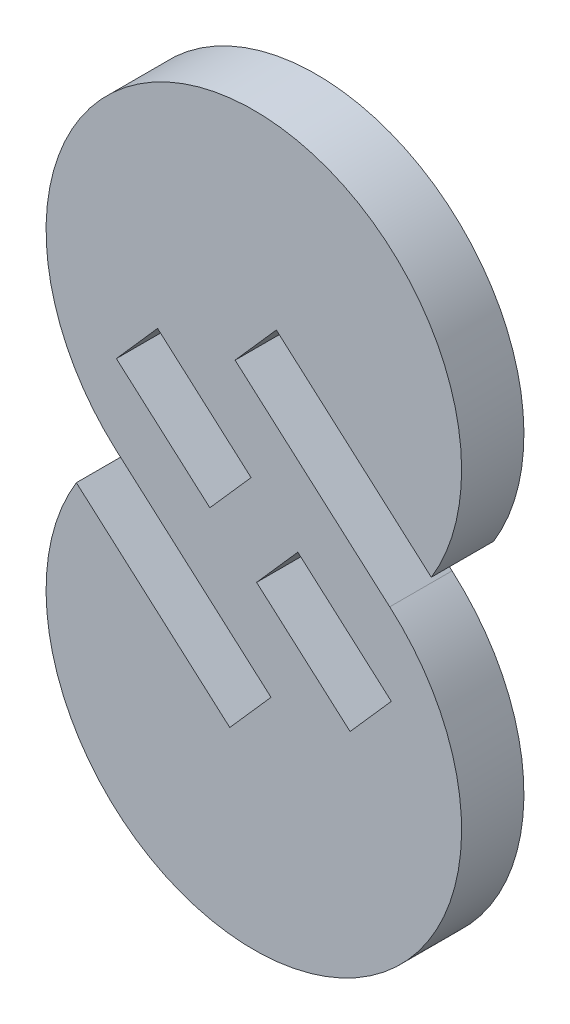
ISO-10303-21;
HEADER;
FILE_DESCRIPTION(('STEP AP214'),'2;1');
FILE_NAME('part.step','',(''),(''),'','','');
FILE_SCHEMA(('AUTOMOTIVE_DESIGN { 1 0 10303 214 1 1 1 1 }'));
ENDSEC;
DATA;
#1=APPLICATION_CONTEXT('core data for automotive mechanical design processes');
#2=APPLICATION_PROTOCOL_DEFINITION('international standard','automotive_design',2000,#1);
#3=PRODUCT_CONTEXT('',#1,'mechanical');
#4=PRODUCT('Part','Part','',(#3));
#5=PRODUCT_RELATED_PRODUCT_CATEGORY('part','',(#4));
#6=PRODUCT_DEFINITION_FORMATION('','',#4);
#7=PRODUCT_DEFINITION_CONTEXT('part definition',#1,'design');
#8=PRODUCT_DEFINITION('design','',#6,#7);
#9=PRODUCT_DEFINITION_SHAPE('','',#8);
#10=(LENGTH_UNIT() NAMED_UNIT(*) SI_UNIT(.MILLI.,.METRE.));
#11=(NAMED_UNIT(*) PLANE_ANGLE_UNIT() SI_UNIT($,.RADIAN.));
#12=(NAMED_UNIT(*) SI_UNIT($,.STERADIAN.) SOLID_ANGLE_UNIT());
#13=UNCERTAINTY_MEASURE_WITH_UNIT(LENGTH_MEASURE(1.E-05),#10,'distance_accuracy_value','');
#14=(GEOMETRIC_REPRESENTATION_CONTEXT(3) GLOBAL_UNCERTAINTY_ASSIGNED_CONTEXT((#13)) GLOBAL_UNIT_ASSIGNED_CONTEXT((#10,
#11,#12)) REPRESENTATION_CONTEXT('',''));
#15=CARTESIAN_POINT('',(0.,0.,0.));
#16=DIRECTION('',(0.,0.,1.));
#17=DIRECTION('',(1.,0.,0.));
#18=AXIS2_PLACEMENT_3D('',#15,#16,#17);
#19=CARTESIAN_POINT('',(0.,-15.,3.));
#20=DIRECTION('',(0.,0.,1.));
#21=DIRECTION('',(1.,0.,0.));
#22=AXIS2_PLACEMENT_3D('',#19,#20,#21);
#23=PLANE('',#22);
#24=DIRECTION('',(-0.66144277432984,-0.749995637511875,0.));
#25=VECTOR('',#24,1.);
#26=CARTESIAN_POINT('',(2.59569605670494,-2.28921918367393,3.));
#27=LINE('',#26,#25);
#28=CARTESIAN_POINT('',(-0.132829294773053,-5.38303499037377,3.));
#29=VERTEX_POINT('',#28);
#30=CARTESIAN_POINT('',(-2.11715761776257,-7.63302190290939,3.));
#31=VERTEX_POINT('',#30);
#32=EDGE_CURVE('E165',#29,#31,#27,.T.);
#33=ORIENTED_EDGE('',*,*,#32,.T.);
#34=DIRECTION('',(-0.749995637511876,0.66144277432984,0.));
#35=VECTOR('',#34,1.);
#36=CARTESIAN_POINT('',(-4.71285367446752,-5.34380271923547,3.));
#37=LINE('',#36,#35);
#38=CARTESIAN_POINT('',(-6.61713144283383,-3.66436525693035,3.));
#39=VERTEX_POINT('',#38);
#40=EDGE_CURVE('E152',#31,#39,#37,.T.);
#41=ORIENTED_EDGE('',*,*,#40,.T.);
#42=DIRECTION('',(0.66144277432984,0.749995637511876,0.));
#43=VECTOR('',#42,1.);
#44=CARTESIAN_POINT('',(-1.90427776836631,1.67943746230511,3.));
#45=LINE('',#44,#43);
#46=CARTESIAN_POINT('',(-4.63280311984431,-1.41437834439473,3.));
#47=VERTEX_POINT('',#46);
#48=EDGE_CURVE('E177',#39,#47,#45,.T.);
#49=ORIENTED_EDGE('',*,*,#48,.T.);
#50=DIRECTION('',(-0.749995637511876,0.66144277432984,0.));
#51=VECTOR('',#50,1.);
#52=CARTESIAN_POINT('',(-2.728525351478,-3.09381580669984,3.));
#53=LINE('',#52,#51);
#54=EDGE_CURVE('E173',#29,#47,#53,.T.);
#55=ORIENTED_EDGE('',*,*,#54,.F.);
#56=EDGE_LOOP('',(#33,#41,#49,#55));
#57=FACE_BOUND('',#56,.T.);
#58=DIRECTION('',(-0.66144277432984,-0.749995637511876,0.));
#59=VECTOR('',#58,1.);
#60=CARTESIAN_POINT('',(1.08324299669159,1.37770571202348,3.));
#61=LINE('',#60,#59);
#62=CARTESIAN_POINT('',(1.08324299669159,1.37770571202348,3.));
#63=VERTEX_POINT('',#62);
#64=CARTESIAN_POINT('',(-0.901085326297932,-0.872281200512147,3.));
#65=VERTEX_POINT('',#64);
#66=EDGE_CURVE('E222',#63,#65,#61,.T.);
#67=ORIENTED_EDGE('',*,*,#66,.F.);
#68=DIRECTION('',(0.749995637511875,-0.66144277432984,0.));
#69=VECTOR('',#68,1.);
#70=CARTESIAN_POINT('',(1.08324299669159,1.37770571202348,3.));
#71=LINE('',#70,#69);
#72=CARTESIAN_POINT('',(8.54162712741715,-5.20005827045923,3.));
#73=VERTEX_POINT('',#72);
#74=EDGE_CURVE('E240',#63,#73,#71,.T.);
#75=ORIENTED_EDGE('',*,*,#74,.T.);
#76=CARTESIAN_POINT('',(0.,0.,3.));
#77=DIRECTION('',(0.,0.,1.));
#78=DIRECTION('',(1.,0.,0.));
#79=AXIS2_PLACEMENT_3D('',#76,#77,#78);
#80=CIRCLE('',#79,10.);
#81=CARTESIAN_POINT('',(-6.6144277432984,-7.49995637511875,3.));
#82=VERTEX_POINT('',#81);
#83=EDGE_CURVE('E238',#73,#82,#80,.T.);
#84=ORIENTED_EDGE('',*,*,#83,.T.);
#85=DIRECTION('',(0.749995637511876,-0.66144277432984,0.));
#86=VECTOR('',#85,1.);
#87=CARTESIAN_POINT('',(-6.6144277432984,-7.49995637511875,3.));
#88=LINE('',#87,#86);
#89=CARTESIAN_POINT('',(0.826760184868579,-14.0625545308161,3.));
#90=VERTEX_POINT('',#89);
#91=EDGE_CURVE('E236',#82,#90,#88,.T.);
#92=ORIENTED_EDGE('',*,*,#91,.T.);
#93=DIRECTION('',(-0.661442774329841,-0.749995637511874,0.));
#94=VECTOR('',#93,1.);
#95=CARTESIAN_POINT('',(0.826760184868579,-14.0625545308161,3.));
#96=LINE('',#95,#94);
#97=CARTESIAN_POINT('',(-1.15756813812094,-16.3125414433517,3.));
#98=VERTEX_POINT('',#97);
#99=EDGE_CURVE('E234',#90,#98,#96,.T.);
#100=ORIENTED_EDGE('',*,*,#99,.T.);
#101=DIRECTION('',(0.749995637511875,-0.66144277432984,0.));
#102=VECTOR('',#101,1.);
#103=CARTESIAN_POINT('',(-8.54193177258285,-9.80005827045922,3.));
#104=LINE('',#103,#102);
#105=CARTESIAN_POINT('',(-8.54193177258285,-9.80005827045922,3.));
#106=VERTEX_POINT('',#105);
#107=EDGE_CURVE('E231',#106,#98,#104,.T.);
#108=ORIENTED_EDGE('',*,*,#107,.F.);
#109=CARTESIAN_POINT('',(0.,-15.,3.));
#110=DIRECTION('',(0.,0.,1.));
#111=DIRECTION('',(1.,0.,0.));
#112=AXIS2_PLACEMENT_3D('',#109,#110,#111);
#113=CIRCLE('',#112,10.0001996179116);
#114=CARTESIAN_POINT('',(6.54010260186905,-7.43487935620947,3.));
#115=VERTEX_POINT('',#114);
#116=EDGE_CURVE('E229',#106,#115,#113,.T.);
#117=ORIENTED_EDGE('',*,*,#116,.T.);
#118=DIRECTION('',(0.749995637511876,-0.66144277432984,0.));
#119=VECTOR('',#118,1.);
#120=CARTESIAN_POINT('',(-0.901085326297932,-0.872281200512147,3.));
#121=LINE('',#120,#119);
#122=EDGE_CURVE('E225',#65,#115,#121,.T.);
#123=ORIENTED_EDGE('',*,*,#122,.F.);
#124=EDGE_LOOP('',(#67,#75,#84,#92,#100,#108,#117,#123));
#125=FACE_BOUND('',#124,.T.);
#126=DIRECTION('',(-0.749995637511875,0.66144277432984,0.));
#127=VECTOR('',#126,1.);
#128=CARTESIAN_POINT('',(-4.71285367446752,-5.34380271923547,3.));
#129=LINE('',#128,#127);
#130=CARTESIAN_POINT('',(4.6328031198443,-13.5860068718779,3.));
#131=VERTEX_POINT('',#130);
#132=CARTESIAN_POINT('',(0.132829294773053,-9.61735022589891,3.));
#133=VERTEX_POINT('',#132);
#134=EDGE_CURVE('E192',#131,#133,#129,.T.);
#135=ORIENTED_EDGE('',*,*,#134,.T.);
#136=DIRECTION('',(-0.66144277432984,-0.749995637511876,0.));
#137=VECTOR('',#136,1.);
#138=CARTESIAN_POINT('',(4.84568296924057,-4.27354750666345,3.));
#139=LINE('',#138,#137);
#140=CARTESIAN_POINT('',(2.11715761776257,-7.36736331336329,3.));
#141=VERTEX_POINT('',#140);
#142=EDGE_CURVE('E195',#141,#133,#139,.T.);
#143=ORIENTED_EDGE('',*,*,#142,.F.);
#144=DIRECTION('',(-0.749995637511875,0.66144277432984,0.));
#145=VECTOR('',#144,1.);
#146=CARTESIAN_POINT('',(-2.728525351478,-3.09381580669984,3.));
#147=LINE('',#146,#145);
#148=CARTESIAN_POINT('',(6.61713144283382,-11.3360199593423,3.));
#149=VERTEX_POINT('',#148);
#150=EDGE_CURVE('E213',#149,#141,#147,.T.);
#151=ORIENTED_EDGE('',*,*,#150,.F.);
#152=DIRECTION('',(0.661442774329839,0.749995637511876,0.));
#153=VECTOR('',#152,1.);
#154=CARTESIAN_POINT('',(9.34565679431182,-8.24220415264247,3.));
#155=LINE('',#154,#153);
#156=EDGE_CURVE('E64',#131,#149,#155,.T.);
#157=ORIENTED_EDGE('',*,*,#156,.F.);
#158=EDGE_LOOP('',(#135,#143,#151,#157));
#159=FACE_BOUND('',#158,.T.);
#160=ADVANCED_FACE('F39',(#57,#125,#159),#23,.T.);
#161=CARTESIAN_POINT('',(0.,-15.,0.));
#162=DIRECTION('',(0.,0.,1.));
#163=DIRECTION('',(1.,0.,0.));
#164=AXIS2_PLACEMENT_3D('',#161,#162,#163);
#165=PLANE('',#164);
#166=DIRECTION('',(-0.749995637511876,0.66144277432984,0.));
#167=VECTOR('',#166,1.);
#168=CARTESIAN_POINT('',(-4.71285367446752,-5.34380271923547,0.));
#169=LINE('',#168,#167);
#170=CARTESIAN_POINT('',(-2.11715761776257,-7.63302190290939,0.));
#171=VERTEX_POINT('',#170);
#172=CARTESIAN_POINT('',(-6.61713144283383,-3.66436525693036,0.));
#173=VERTEX_POINT('',#172);
#174=EDGE_CURVE('E175',#171,#173,#169,.T.);
#175=ORIENTED_EDGE('',*,*,#174,.F.);
#176=DIRECTION('',(-0.66144277432984,-0.749995637511875,0.));
#177=VECTOR('',#176,1.);
#178=CARTESIAN_POINT('',(2.59569605670494,-2.28921918367393,0.));
#179=LINE('',#178,#177);
#180=CARTESIAN_POINT('',(-0.132829294773054,-5.38303499037377,0.));
#181=VERTEX_POINT('',#180);
#182=EDGE_CURVE('E168',#181,#171,#179,.T.);
#183=ORIENTED_EDGE('',*,*,#182,.F.);
#184=DIRECTION('',(-0.749995637511876,0.66144277432984,0.));
#185=VECTOR('',#184,1.);
#186=CARTESIAN_POINT('',(-2.728525351478,-3.09381580669984,0.));
#187=LINE('',#186,#185);
#188=CARTESIAN_POINT('',(-4.63280311984431,-1.41437834439473,0.));
#189=VERTEX_POINT('',#188);
#190=EDGE_CURVE('E169',#181,#189,#187,.T.);
#191=ORIENTED_EDGE('',*,*,#190,.T.);
#192=DIRECTION('',(0.66144277432984,0.749995637511876,0.));
#193=VECTOR('',#192,1.);
#194=CARTESIAN_POINT('',(-1.90427776836631,1.67943746230511,0.));
#195=LINE('',#194,#193);
#196=EDGE_CURVE('E182',#173,#189,#195,.T.);
#197=ORIENTED_EDGE('',*,*,#196,.F.);
#198=EDGE_LOOP('',(#175,#183,#191,#197));
#199=FACE_BOUND('',#198,.T.);
#200=DIRECTION('',(-0.66144277432984,-0.749995637511876,0.));
#201=VECTOR('',#200,1.);
#202=CARTESIAN_POINT('',(1.08324299669159,1.37770571202348,0.));
#203=LINE('',#202,#201);
#204=CARTESIAN_POINT('',(1.08324299669159,1.37770571202348,0.));
#205=VERTEX_POINT('',#204);
#206=CARTESIAN_POINT('',(-0.901085326297932,-0.872281200512147,0.));
#207=VERTEX_POINT('',#206);
#208=EDGE_CURVE('E160',#205,#207,#203,.T.);
#209=ORIENTED_EDGE('',*,*,#208,.T.);
#210=DIRECTION('',(0.749995637511876,-0.66144277432984,0.));
#211=VECTOR('',#210,1.);
#212=CARTESIAN_POINT('',(-0.901085326297932,-0.872281200512147,0.));
#213=LINE('',#212,#211);
#214=CARTESIAN_POINT('',(6.54010260186905,-7.43487935620947,0.));
#215=VERTEX_POINT('',#214);
#216=EDGE_CURVE('E244',#207,#215,#213,.T.);
#217=ORIENTED_EDGE('',*,*,#216,.T.);
#218=CARTESIAN_POINT('',(0.,-15.,0.));
#219=DIRECTION('',(0.,0.,1.));
#220=DIRECTION('',(1.,0.,0.));
#221=AXIS2_PLACEMENT_3D('',#218,#219,#220);
#222=CIRCLE('',#221,10.0001996179116);
#223=CARTESIAN_POINT('',(-8.54193177258285,-9.80005827045922,0.));
#224=VERTEX_POINT('',#223);
#225=EDGE_CURVE('E247',#224,#215,#222,.T.);
#226=ORIENTED_EDGE('',*,*,#225,.F.);
#227=DIRECTION('',(0.749995637511875,-0.66144277432984,0.));
#228=VECTOR('',#227,1.);
#229=CARTESIAN_POINT('',(-8.54193177258285,-9.80005827045922,0.));
#230=LINE('',#229,#228);
#231=CARTESIAN_POINT('',(-1.15756813812094,-16.3125414433517,0.));
#232=VERTEX_POINT('',#231);
#233=EDGE_CURVE('E250',#224,#232,#230,.T.);
#234=ORIENTED_EDGE('',*,*,#233,.T.);
#235=DIRECTION('',(-0.661442774329841,-0.749995637511874,0.));
#236=VECTOR('',#235,1.);
#237=CARTESIAN_POINT('',(0.826760184868579,-14.0625545308161,0.));
#238=LINE('',#237,#236);
#239=CARTESIAN_POINT('',(0.826760184868579,-14.0625545308161,0.));
#240=VERTEX_POINT('',#239);
#241=EDGE_CURVE('E253',#240,#232,#238,.T.);
#242=ORIENTED_EDGE('',*,*,#241,.F.);
#243=DIRECTION('',(0.749995637511876,-0.66144277432984,0.));
#244=VECTOR('',#243,1.);
#245=CARTESIAN_POINT('',(-6.6144277432984,-7.49995637511875,0.));
#246=LINE('',#245,#244);
#247=CARTESIAN_POINT('',(-6.6144277432984,-7.49995637511875,0.));
#248=VERTEX_POINT('',#247);
#249=EDGE_CURVE('E256',#248,#240,#246,.T.);
#250=ORIENTED_EDGE('',*,*,#249,.F.);
#251=CARTESIAN_POINT('',(0.,0.,0.));
#252=DIRECTION('',(0.,0.,1.));
#253=DIRECTION('',(1.,0.,0.));
#254=AXIS2_PLACEMENT_3D('',#251,#252,#253);
#255=CIRCLE('',#254,10.);
#256=CARTESIAN_POINT('',(8.54162712741715,-5.20005827045923,0.));
#257=VERTEX_POINT('',#256);
#258=EDGE_CURVE('E258',#257,#248,#255,.T.);
#259=ORIENTED_EDGE('',*,*,#258,.F.);
#260=DIRECTION('',(0.749995637511875,-0.66144277432984,0.));
#261=VECTOR('',#260,1.);
#262=CARTESIAN_POINT('',(1.08324299669159,1.37770571202348,0.));
#263=LINE('',#262,#261);
#264=EDGE_CURVE('E226',#205,#257,#263,.T.);
#265=ORIENTED_EDGE('',*,*,#264,.F.);
#266=EDGE_LOOP('',(#209,#217,#226,#234,#242,#250,#259,#265));
#267=FACE_BOUND('',#266,.T.);
#268=DIRECTION('',(-0.66144277432984,-0.749995637511876,0.));
#269=VECTOR('',#268,1.);
#270=CARTESIAN_POINT('',(4.84568296924057,-4.27354750666345,0.));
#271=LINE('',#270,#269);
#272=CARTESIAN_POINT('',(2.11715761776257,-7.36736331336329,0.));
#273=VERTEX_POINT('',#272);
#274=CARTESIAN_POINT('',(0.132829294773053,-9.61735022589891,0.));
#275=VERTEX_POINT('',#274);
#276=EDGE_CURVE('E198',#273,#275,#271,.T.);
#277=ORIENTED_EDGE('',*,*,#276,.T.);
#278=DIRECTION('',(-0.749995637511875,0.66144277432984,0.));
#279=VECTOR('',#278,1.);
#280=CARTESIAN_POINT('',(-4.71285367446752,-5.34380271923547,0.));
#281=LINE('',#280,#279);
#282=CARTESIAN_POINT('',(4.6328031198443,-13.5860068718779,0.));
#283=VERTEX_POINT('',#282);
#284=EDGE_CURVE('E207',#283,#275,#281,.T.);
#285=ORIENTED_EDGE('',*,*,#284,.F.);
#286=DIRECTION('',(0.661442774329839,0.749995637511876,0.));
#287=VECTOR('',#286,1.);
#288=CARTESIAN_POINT('',(9.34565679431182,-8.24220415264247,0.));
#289=LINE('',#288,#287);
#290=CARTESIAN_POINT('',(6.61713144283382,-11.3360199593423,0.));
#291=VERTEX_POINT('',#290);
#292=EDGE_CURVE('E204',#283,#291,#289,.T.);
#293=ORIENTED_EDGE('',*,*,#292,.T.);
#294=DIRECTION('',(-0.749995637511875,0.66144277432984,0.));
#295=VECTOR('',#294,1.);
#296=CARTESIAN_POINT('',(-2.728525351478,-3.09381580669984,0.));
#297=LINE('',#296,#295);
#298=EDGE_CURVE('E201',#291,#273,#297,.T.);
#299=ORIENTED_EDGE('',*,*,#298,.T.);
#300=EDGE_LOOP('',(#277,#285,#293,#299));
#301=FACE_BOUND('',#300,.T.);
#302=ADVANCED_FACE('F284',(#199,#267,#301),#165,.F.);
#303=CARTESIAN_POINT('',(1.08324299669159,1.37770571202348,3.));
#304=DIRECTION('',(0.749995637511876,-0.66144277432984,0.));
#305=DIRECTION('',(0.66144277432984,0.749995637511876,0.));
#306=AXIS2_PLACEMENT_3D('',#303,#304,#305);
#307=PLANE('',#306);
#308=ORIENTED_EDGE('',*,*,#208,.F.);
#309=DIRECTION('',(0.,0.,-1.));
#310=VECTOR('',#309,1.);
#311=CARTESIAN_POINT('',(1.08324299669159,1.37770571202348,3.));
#312=LINE('',#311,#310);
#313=EDGE_CURVE('E11',#63,#205,#312,.T.);
#314=ORIENTED_EDGE('',*,*,#313,.F.);
#315=ORIENTED_EDGE('',*,*,#66,.T.);
#316=DIRECTION('',(0.,0.,-1.));
#317=VECTOR('',#316,1.);
#318=CARTESIAN_POINT('',(-0.901085326297932,-0.872281200512147,3.));
#319=LINE('',#318,#317);
#320=EDGE_CURVE('E43',#65,#207,#319,.T.);
#321=ORIENTED_EDGE('',*,*,#320,.T.);
#322=EDGE_LOOP('',(#308,#314,#315,#321));
#323=FACE_BOUND('',#322,.T.);
#324=ADVANCED_FACE('F41',(#323),#307,.T.);
#325=CARTESIAN_POINT('',(1.08324299669159,1.37770571202348,3.));
#326=DIRECTION('',(0.66144277432984,0.749995637511875,0.));
#327=DIRECTION('',(-0.749995637511875,0.66144277432984,0.));
#328=AXIS2_PLACEMENT_3D('',#325,#326,#327);
#329=PLANE('',#328);
#330=ORIENTED_EDGE('',*,*,#264,.T.);
#331=DIRECTION('',(0.,0.,-1.));
#332=VECTOR('',#331,1.);
#333=CARTESIAN_POINT('',(8.54162712741715,-5.20005827045923,3.));
#334=LINE('',#333,#332);
#335=EDGE_CURVE('E48',#73,#257,#334,.T.);
#336=ORIENTED_EDGE('',*,*,#335,.F.);
#337=ORIENTED_EDGE('',*,*,#74,.F.);
#338=ORIENTED_EDGE('',*,*,#313,.T.);
#339=EDGE_LOOP('',(#330,#336,#337,#338));
#340=FACE_BOUND('',#339,.T.);
#341=ADVANCED_FACE('F290',(#340),#329,.F.);
#342=CARTESIAN_POINT('',(0.,0.,3.));
#343=DIRECTION('',(0.,0.,-1.));
#344=DIRECTION('',(-1.,0.,0.));
#345=AXIS2_PLACEMENT_3D('',#342,#343,#344);
#346=CYLINDRICAL_SURFACE('',#345,10.);
#347=ORIENTED_EDGE('',*,*,#258,.T.);
#348=DIRECTION('',(0.,0.,-1.));
#349=VECTOR('',#348,1.);
#350=CARTESIAN_POINT('',(-6.6144277432984,-7.49995637511875,3.));
#351=LINE('',#350,#349);
#352=EDGE_CURVE('E263',#82,#248,#351,.T.);
#353=ORIENTED_EDGE('',*,*,#352,.F.);
#354=ORIENTED_EDGE('',*,*,#83,.F.);
#355=ORIENTED_EDGE('',*,*,#335,.T.);
#356=EDGE_LOOP('',(#347,#353,#354,#355));
#357=FACE_BOUND('',#356,.T.);
#358=ADVANCED_FACE('F294',(#357),#346,.T.);
#359=CARTESIAN_POINT('',(-6.6144277432984,-7.49995637511875,3.));
#360=DIRECTION('',(0.66144277432984,0.749995637511875,0.));
#361=DIRECTION('',(-0.749995637511875,0.66144277432984,0.));
#362=AXIS2_PLACEMENT_3D('',#359,#360,#361);
#363=PLANE('',#362);
#364=ORIENTED_EDGE('',*,*,#249,.T.);
#365=DIRECTION('',(0.,0.,-1.));
#366=VECTOR('',#365,1.);
#367=CARTESIAN_POINT('',(0.826760184868579,-14.0625545308161,3.));
#368=LINE('',#367,#366);
#369=EDGE_CURVE('E266',#90,#240,#368,.T.);
#370=ORIENTED_EDGE('',*,*,#369,.F.);
#371=ORIENTED_EDGE('',*,*,#91,.F.);
#372=ORIENTED_EDGE('',*,*,#352,.T.);
#373=EDGE_LOOP('',(#364,#370,#371,#372));
#374=FACE_BOUND('',#373,.T.);
#375=ADVANCED_FACE('F312',(#374),#363,.F.);
#376=CARTESIAN_POINT('',(0.826760184868579,-14.0625545308161,3.));
#377=DIRECTION('',(0.749995637511874,-0.661442774329841,0.));
#378=DIRECTION('',(0.661442774329841,0.749995637511874,0.));
#379=AXIS2_PLACEMENT_3D('',#376,#377,#378);
#380=PLANE('',#379);
#381=ORIENTED_EDGE('',*,*,#241,.T.);
#382=DIRECTION('',(0.,0.,-1.));
#383=VECTOR('',#382,1.);
#384=CARTESIAN_POINT('',(-1.15756813812094,-16.3125414433517,3.));
#385=LINE('',#384,#383);
#386=EDGE_CURVE('E269',#98,#232,#385,.T.);
#387=ORIENTED_EDGE('',*,*,#386,.F.);
#388=ORIENTED_EDGE('',*,*,#99,.F.);
#389=ORIENTED_EDGE('',*,*,#369,.T.);
#390=EDGE_LOOP('',(#381,#387,#388,#389));
#391=FACE_BOUND('',#390,.T.);
#392=ADVANCED_FACE('F310',(#391),#380,.F.);
#393=CARTESIAN_POINT('',(-8.54193177258285,-9.80005827045922,3.));
#394=DIRECTION('',(0.66144277432984,0.749995637511875,0.));
#395=DIRECTION('',(-0.749995637511875,0.66144277432984,0.));
#396=AXIS2_PLACEMENT_3D('',#393,#394,#395);
#397=PLANE('',#396);
#398=ORIENTED_EDGE('',*,*,#233,.F.);
#399=DIRECTION('',(0.,0.,-1.));
#400=VECTOR('',#399,1.);
#401=CARTESIAN_POINT('',(-8.54193177258285,-9.80005827045922,3.));
#402=LINE('',#401,#400);
#403=EDGE_CURVE('E271',#106,#224,#402,.T.);
#404=ORIENTED_EDGE('',*,*,#403,.F.);
#405=ORIENTED_EDGE('',*,*,#107,.T.);
#406=ORIENTED_EDGE('',*,*,#386,.T.);
#407=EDGE_LOOP('',(#398,#404,#405,#406));
#408=FACE_BOUND('',#407,.T.);
#409=ADVANCED_FACE('F306',(#408),#397,.T.);
#410=CARTESIAN_POINT('',(0.,-15.,3.));
#411=DIRECTION('',(0.,0.,-1.));
#412=DIRECTION('',(-1.,0.,0.));
#413=AXIS2_PLACEMENT_3D('',#410,#411,#412);
#414=CYLINDRICAL_SURFACE('',#413,10.0001996179116);
#415=ORIENTED_EDGE('',*,*,#225,.T.);
#416=DIRECTION('',(0.,0.,-1.));
#417=VECTOR('',#416,1.);
#418=CARTESIAN_POINT('',(6.54010260186905,-7.43487935620947,3.));
#419=LINE('',#418,#417);
#420=EDGE_CURVE('E272',#115,#215,#419,.T.);
#421=ORIENTED_EDGE('',*,*,#420,.F.);
#422=ORIENTED_EDGE('',*,*,#116,.F.);
#423=ORIENTED_EDGE('',*,*,#403,.T.);
#424=EDGE_LOOP('',(#415,#421,#422,#423));
#425=FACE_BOUND('',#424,.T.);
#426=ADVANCED_FACE('F302',(#425),#414,.T.);
#427=CARTESIAN_POINT('',(-0.901085326297932,-0.872281200512147,3.));
#428=DIRECTION('',(0.66144277432984,0.749995637511876,0.));
#429=DIRECTION('',(-0.749995637511876,0.66144277432984,0.));
#430=AXIS2_PLACEMENT_3D('',#427,#428,#429);
#431=PLANE('',#430);
#432=ORIENTED_EDGE('',*,*,#216,.F.);
#433=ORIENTED_EDGE('',*,*,#320,.F.);
#434=ORIENTED_EDGE('',*,*,#122,.T.);
#435=ORIENTED_EDGE('',*,*,#420,.T.);
#436=EDGE_LOOP('',(#432,#433,#434,#435));
#437=FACE_BOUND('',#436,.T.);
#438=ADVANCED_FACE('F280',(#437),#431,.T.);
#439=CARTESIAN_POINT('',(4.84568296924057,-4.27354750666345,3.001));
#440=DIRECTION('',(0.749995637511876,-0.66144277432984,0.));
#441=DIRECTION('',(0.66144277432984,0.749995637511876,0.));
#442=AXIS2_PLACEMENT_3D('',#439,#440,#441);
#443=PLANE('',#442);
#444=ORIENTED_EDGE('',*,*,#142,.T.);
#445=DIRECTION('',(0.,0.,-1.));
#446=VECTOR('',#445,1.);
#447=CARTESIAN_POINT('',(0.132829294773053,-9.61735022589891,3.001));
#448=LINE('',#447,#446);
#449=EDGE_CURVE('E211',#133,#275,#448,.T.);
#450=ORIENTED_EDGE('',*,*,#449,.T.);
#451=ORIENTED_EDGE('',*,*,#276,.F.);
#452=DIRECTION('',(0.,0.,-1.));
#453=VECTOR('',#452,1.);
#454=CARTESIAN_POINT('',(2.11715761776257,-7.36736331336329,3.001));
#455=LINE('',#454,#453);
#456=EDGE_CURVE('E210',#141,#273,#455,.T.);
#457=ORIENTED_EDGE('',*,*,#456,.F.);
#458=EDGE_LOOP('',(#444,#450,#451,#457));
#459=FACE_BOUND('',#458,.T.);
#460=ADVANCED_FACE('F329',(#459),#443,.T.);
#461=CARTESIAN_POINT('',(-4.71285367446752,-5.34380271923547,3.001));
#462=DIRECTION('',(-0.66144277432984,-0.749995637511875,0.));
#463=DIRECTION('',(0.749995637511875,-0.66144277432984,0.));
#464=AXIS2_PLACEMENT_3D('',#461,#462,#463);
#465=PLANE('',#464);
#466=DIRECTION('',(0.,0.,-1.));
#467=VECTOR('',#466,1.);
#468=CARTESIAN_POINT('',(4.6328031198443,-13.5860068718779,3.001));
#469=LINE('',#468,#467);
#470=EDGE_CURVE('E214',#131,#283,#469,.T.);
#471=ORIENTED_EDGE('',*,*,#470,.T.);
#472=ORIENTED_EDGE('',*,*,#284,.T.);
#473=ORIENTED_EDGE('',*,*,#449,.F.);
#474=ORIENTED_EDGE('',*,*,#134,.F.);
#475=EDGE_LOOP('',(#471,#472,#473,#474));
#476=FACE_BOUND('',#475,.T.);
#477=ADVANCED_FACE('F355',(#476),#465,.F.);
#478=CARTESIAN_POINT('',(9.34565679431182,-8.24220415264247,3.001));
#479=DIRECTION('',(-0.749995637511876,0.661442774329839,0.));
#480=DIRECTION('',(-0.661442774329839,-0.749995637511876,0.));
#481=AXIS2_PLACEMENT_3D('',#478,#479,#480);
#482=PLANE('',#481);
#483=ORIENTED_EDGE('',*,*,#156,.T.);
#484=DIRECTION('',(0.,0.,-1.));
#485=VECTOR('',#484,1.);
#486=CARTESIAN_POINT('',(6.61713144283382,-11.3360199593423,3.001));
#487=LINE('',#486,#485);
#488=EDGE_CURVE('E216',#149,#291,#487,.T.);
#489=ORIENTED_EDGE('',*,*,#488,.T.);
#490=ORIENTED_EDGE('',*,*,#292,.F.);
#491=ORIENTED_EDGE('',*,*,#470,.F.);
#492=EDGE_LOOP('',(#483,#489,#490,#491));
#493=FACE_BOUND('',#492,.T.);
#494=ADVANCED_FACE('F365',(#493),#482,.T.);
#495=CARTESIAN_POINT('',(-2.728525351478,-3.09381580669984,3.001));
#496=DIRECTION('',(-0.66144277432984,-0.749995637511875,0.));
#497=DIRECTION('',(0.749995637511875,-0.66144277432984,0.));
#498=AXIS2_PLACEMENT_3D('',#495,#496,#497);
#499=PLANE('',#498);
#500=ORIENTED_EDGE('',*,*,#150,.T.);
#501=ORIENTED_EDGE('',*,*,#456,.T.);
#502=ORIENTED_EDGE('',*,*,#298,.F.);
#503=ORIENTED_EDGE('',*,*,#488,.F.);
#504=EDGE_LOOP('',(#500,#501,#502,#503));
#505=FACE_BOUND('',#504,.T.);
#506=ADVANCED_FACE('F375',(#505),#499,.T.);
#507=CARTESIAN_POINT('',(2.59569605670494,-2.28921918367393,3.001));
#508=DIRECTION('',(0.749995637511875,-0.66144277432984,0.));
#509=DIRECTION('',(0.66144277432984,0.749995637511875,0.));
#510=AXIS2_PLACEMENT_3D('',#507,#508,#509);
#511=PLANE('',#510);
#512=DIRECTION('',(0.,0.,-1.));
#513=VECTOR('',#512,1.);
#514=CARTESIAN_POINT('',(-0.132829294773054,-5.38303499037377,3.001));
#515=LINE('',#514,#513);
#516=EDGE_CURVE('E161',#29,#181,#515,.T.);
#517=ORIENTED_EDGE('',*,*,#516,.T.);
#518=ORIENTED_EDGE('',*,*,#182,.T.);
#519=DIRECTION('',(0.,0.,-1.));
#520=VECTOR('',#519,1.);
#521=CARTESIAN_POINT('',(-2.11715761776257,-7.63302190290939,3.001));
#522=LINE('',#521,#520);
#523=EDGE_CURVE('E155',#31,#171,#522,.T.);
#524=ORIENTED_EDGE('',*,*,#523,.F.);
#525=ORIENTED_EDGE('',*,*,#32,.F.);
#526=EDGE_LOOP('',(#517,#518,#524,#525));
#527=FACE_BOUND('',#526,.T.);
#528=ADVANCED_FACE('F164',(#527),#511,.F.);
#529=CARTESIAN_POINT('',(-2.728525351478,-3.09381580669984,3.001));
#530=DIRECTION('',(-0.66144277432984,-0.749995637511876,0.));
#531=DIRECTION('',(0.749995637511876,-0.66144277432984,0.));
#532=AXIS2_PLACEMENT_3D('',#529,#530,#531);
#533=PLANE('',#532);
#534=ORIENTED_EDGE('',*,*,#54,.T.);
#535=DIRECTION('',(0.,0.,-1.));
#536=VECTOR('',#535,1.);
#537=CARTESIAN_POINT('',(-4.63280311984431,-1.41437834439473,3.001));
#538=LINE('',#537,#536);
#539=EDGE_CURVE('E188',#47,#189,#538,.T.);
#540=ORIENTED_EDGE('',*,*,#539,.T.);
#541=ORIENTED_EDGE('',*,*,#190,.F.);
#542=ORIENTED_EDGE('',*,*,#516,.F.);
#543=EDGE_LOOP('',(#534,#540,#541,#542));
#544=FACE_BOUND('',#543,.T.);
#545=ADVANCED_FACE('F392',(#544),#533,.T.);
#546=CARTESIAN_POINT('',(-1.90427776836631,1.67943746230511,3.001));
#547=DIRECTION('',(-0.749995637511876,0.66144277432984,0.));
#548=DIRECTION('',(-0.66144277432984,-0.749995637511876,0.));
#549=AXIS2_PLACEMENT_3D('',#546,#547,#548);
#550=PLANE('',#549);
#551=DIRECTION('',(0.,0.,-1.));
#552=VECTOR('',#551,1.);
#553=CARTESIAN_POINT('',(-6.61713144283383,-3.66436525693036,3.001));
#554=LINE('',#553,#552);
#555=EDGE_CURVE('E56',#39,#173,#554,.T.);
#556=ORIENTED_EDGE('',*,*,#555,.T.);
#557=ORIENTED_EDGE('',*,*,#196,.T.);
#558=ORIENTED_EDGE('',*,*,#539,.F.);
#559=ORIENTED_EDGE('',*,*,#48,.F.);
#560=EDGE_LOOP('',(#556,#557,#558,#559));
#561=FACE_BOUND('',#560,.T.);
#562=ADVANCED_FACE('F401',(#561),#550,.F.);
#563=CARTESIAN_POINT('',(-4.71285367446752,-5.34380271923547,3.001));
#564=DIRECTION('',(-0.66144277432984,-0.749995637511876,0.));
#565=DIRECTION('',(0.749995637511876,-0.66144277432984,0.));
#566=AXIS2_PLACEMENT_3D('',#563,#564,#565);
#567=PLANE('',#566);
#568=ORIENTED_EDGE('',*,*,#523,.T.);
#569=ORIENTED_EDGE('',*,*,#174,.T.);
#570=ORIENTED_EDGE('',*,*,#555,.F.);
#571=ORIENTED_EDGE('',*,*,#40,.F.);
#572=EDGE_LOOP('',(#568,#569,#570,#571));
#573=FACE_BOUND('',#572,.T.);
#574=ADVANCED_FACE('F154',(#573),#567,.F.);
#575=CLOSED_SHELL('',(#160,#302,#324,#341,#358,#375,#392,#409,#426,#438,#460,#477,#494,#506,
#528,#545,#562,#574));
#576=MANIFOLD_SOLID_BREP('B2',#575);
#577=ADVANCED_BREP_SHAPE_REPRESENTATION('',(#18,#576),#14);
#578=SHAPE_DEFINITION_REPRESENTATION(#9,#577);
ENDSEC;
END-ISO-10303-21;
